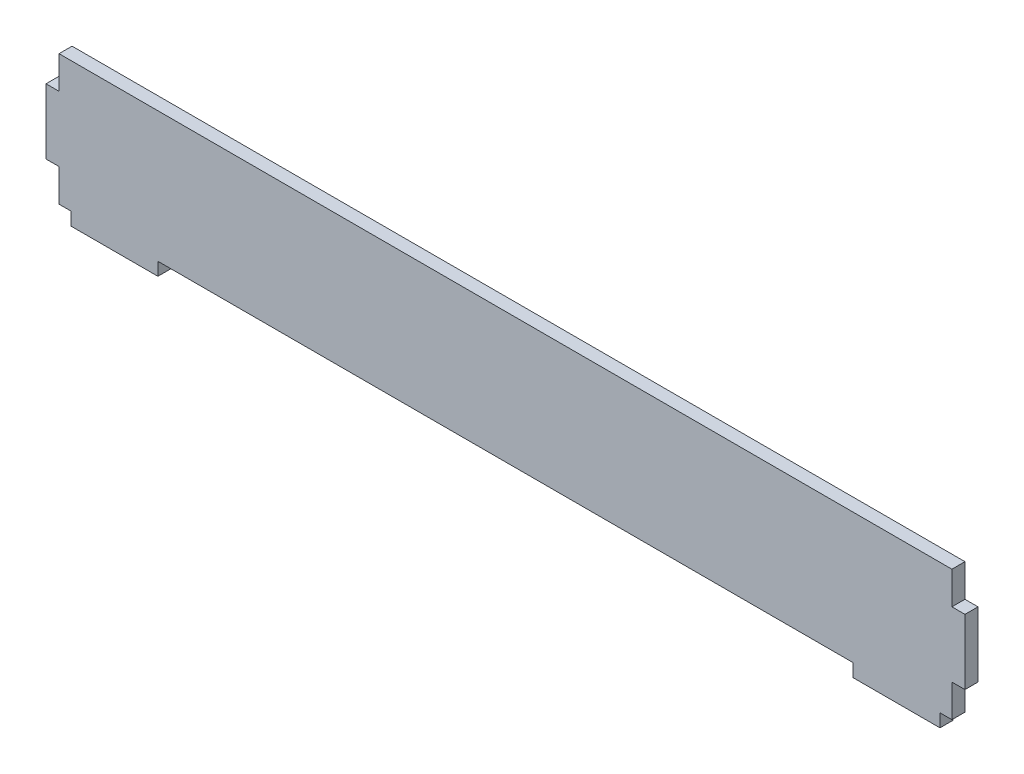
ISO-10303-21;
HEADER;
FILE_DESCRIPTION(('STEP AP214'),'2;1');
FILE_NAME('part.step','',(''),(''),'','','');
FILE_SCHEMA(('AUTOMOTIVE_DESIGN { 1 0 10303 214 1 1 1 1 }'));
ENDSEC;
DATA;
#1=APPLICATION_CONTEXT('core data for automotive mechanical design processes');
#2=APPLICATION_PROTOCOL_DEFINITION('international standard','automotive_design',2000,#1);
#3=PRODUCT_CONTEXT('',#1,'mechanical');
#4=PRODUCT('Part','Part','',(#3));
#5=PRODUCT_RELATED_PRODUCT_CATEGORY('part','',(#4));
#6=PRODUCT_DEFINITION_FORMATION('','',#4);
#7=PRODUCT_DEFINITION_CONTEXT('part definition',#1,'design');
#8=PRODUCT_DEFINITION('design','',#6,#7);
#9=PRODUCT_DEFINITION_SHAPE('','',#8);
#10=(LENGTH_UNIT() NAMED_UNIT(*) SI_UNIT(.MILLI.,.METRE.));
#11=(NAMED_UNIT(*) PLANE_ANGLE_UNIT() SI_UNIT($,.RADIAN.));
#12=(NAMED_UNIT(*) SI_UNIT($,.STERADIAN.) SOLID_ANGLE_UNIT());
#13=UNCERTAINTY_MEASURE_WITH_UNIT(LENGTH_MEASURE(1.E-05),#10,'distance_accuracy_value','');
#14=(GEOMETRIC_REPRESENTATION_CONTEXT(3) GLOBAL_UNCERTAINTY_ASSIGNED_CONTEXT((#13)) GLOBAL_UNIT_ASSIGNED_CONTEXT((#10,
#11,#12)) REPRESENTATION_CONTEXT('',''));
#15=CARTESIAN_POINT('',(0.,0.,0.));
#16=DIRECTION('',(0.,0.,1.));
#17=DIRECTION('',(1.,0.,0.));
#18=AXIS2_PLACEMENT_3D('',#15,#16,#17);
#19=CARTESIAN_POINT('',(-2.75,0.,3.));
#20=DIRECTION('',(0.,1.,0.));
#21=DIRECTION('',(0.,0.,1.));
#22=AXIS2_PLACEMENT_3D('',#19,#20,#21);
#23=PLANE('',#22);
#24=DIRECTION('',(1.,0.,0.));
#25=VECTOR('',#24,1.);
#26=CARTESIAN_POINT('',(-2.75,0.,0.));
#27=LINE('',#26,#25);
#28=CARTESIAN_POINT('',(-2.75,0.,0.));
#29=VERTEX_POINT('',#28);
#30=CARTESIAN_POINT('',(0.,0.,0.));
#31=VERTEX_POINT('',#30);
#32=EDGE_CURVE('E212',#29,#31,#27,.T.);
#33=ORIENTED_EDGE('',*,*,#32,.T.);
#34=DIRECTION('',(0.,0.,-1.));
#35=VECTOR('',#34,1.);
#36=CARTESIAN_POINT('',(0.,0.,3.));
#37=LINE('',#36,#35);
#38=CARTESIAN_POINT('',(0.,0.,3.));
#39=VERTEX_POINT('',#38);
#40=EDGE_CURVE('E11',#39,#31,#37,.T.);
#41=ORIENTED_EDGE('',*,*,#40,.F.);
#42=DIRECTION('',(1.,0.,0.));
#43=VECTOR('',#42,1.);
#44=CARTESIAN_POINT('',(-2.75,0.,3.));
#45=LINE('',#44,#43);
#46=CARTESIAN_POINT('',(-2.75,0.,3.));
#47=VERTEX_POINT('',#46);
#48=EDGE_CURVE('E271',#47,#39,#45,.T.);
#49=ORIENTED_EDGE('',*,*,#48,.F.);
#50=DIRECTION('',(0.,0.,-1.));
#51=VECTOR('',#50,1.);
#52=CARTESIAN_POINT('',(-2.75,0.,3.));
#53=LINE('',#52,#51);
#54=EDGE_CURVE('E208',#47,#29,#53,.T.);
#55=ORIENTED_EDGE('',*,*,#54,.T.);
#56=EDGE_LOOP('',(#33,#41,#49,#55));
#57=FACE_BOUND('',#56,.T.);
#58=ADVANCED_FACE('F39',(#57),#23,.F.);
#59=CARTESIAN_POINT('',(0.,0.,3.));
#60=DIRECTION('',(1.,0.,0.));
#61=DIRECTION('',(0.,0.,-1.));
#62=AXIS2_PLACEMENT_3D('',#59,#60,#61);
#63=PLANE('',#62);
#64=DIRECTION('',(0.,-1.,0.));
#65=VECTOR('',#64,1.);
#66=CARTESIAN_POINT('',(0.,0.,0.));
#67=LINE('',#66,#65);
#68=CARTESIAN_POINT('',(0.,-3.,0.));
#69=VERTEX_POINT('',#68);
#70=EDGE_CURVE('E216',#31,#69,#67,.T.);
#71=ORIENTED_EDGE('',*,*,#70,.T.);
#72=DIRECTION('',(0.,0.,-1.));
#73=VECTOR('',#72,1.);
#74=CARTESIAN_POINT('',(0.,-3.,3.));
#75=LINE('',#74,#73);
#76=CARTESIAN_POINT('',(0.,-3.,3.));
#77=VERTEX_POINT('',#76);
#78=EDGE_CURVE('E48',#77,#69,#75,.T.);
#79=ORIENTED_EDGE('',*,*,#78,.F.);
#80=DIRECTION('',(0.,-1.,0.));
#81=VECTOR('',#80,1.);
#82=CARTESIAN_POINT('',(0.,0.,3.));
#83=LINE('',#82,#81);
#84=EDGE_CURVE('E135',#39,#77,#83,.T.);
#85=ORIENTED_EDGE('',*,*,#84,.F.);
#86=ORIENTED_EDGE('',*,*,#40,.T.);
#87=EDGE_LOOP('',(#71,#79,#85,#86));
#88=FACE_BOUND('',#87,.T.);
#89=ADVANCED_FACE('F421',(#88),#63,.F.);
#90=CARTESIAN_POINT('',(0.,-3.,3.));
#91=DIRECTION('',(0.,1.,0.));
#92=DIRECTION('',(0.,0.,1.));
#93=AXIS2_PLACEMENT_3D('',#90,#91,#92);
#94=PLANE('',#93);
#95=DIRECTION('',(1.,0.,0.));
#96=VECTOR('',#95,1.);
#97=CARTESIAN_POINT('',(0.,-3.,0.));
#98=LINE('',#97,#96);
#99=CARTESIAN_POINT('',(20.,-3.,0.));
#100=VERTEX_POINT('',#99);
#101=EDGE_CURVE('E219',#69,#100,#98,.T.);
#102=ORIENTED_EDGE('',*,*,#101,.T.);
#103=DIRECTION('',(0.,0.,-1.));
#104=VECTOR('',#103,1.);
#105=CARTESIAN_POINT('',(20.,-3.,3.));
#106=LINE('',#105,#104);
#107=CARTESIAN_POINT('',(20.,-3.,3.));
#108=VERTEX_POINT('',#107);
#109=EDGE_CURVE('E330',#108,#100,#106,.T.);
#110=ORIENTED_EDGE('',*,*,#109,.F.);
#111=DIRECTION('',(1.,0.,0.));
#112=VECTOR('',#111,1.);
#113=CARTESIAN_POINT('',(0.,-3.,3.));
#114=LINE('',#113,#112);
#115=EDGE_CURVE('E340',#77,#108,#114,.T.);
#116=ORIENTED_EDGE('',*,*,#115,.F.);
#117=ORIENTED_EDGE('',*,*,#78,.T.);
#118=EDGE_LOOP('',(#102,#110,#116,#117));
#119=FACE_BOUND('',#118,.T.);
#120=ADVANCED_FACE('F338',(#119),#94,.F.);
#121=CARTESIAN_POINT('',(20.,0.,3.));
#122=DIRECTION('',(-1.,0.,0.));
#123=DIRECTION('',(0.,0.,1.));
#124=AXIS2_PLACEMENT_3D('',#121,#122,#123);
#125=PLANE('',#124);
#126=DIRECTION('',(0.,1.,0.));
#127=VECTOR('',#126,1.);
#128=CARTESIAN_POINT('',(20.,0.,0.));
#129=LINE('',#128,#127);
#130=CARTESIAN_POINT('',(20.,0.,0.));
#131=VERTEX_POINT('',#130);
#132=EDGE_CURVE('E222',#100,#131,#129,.T.);
#133=ORIENTED_EDGE('',*,*,#132,.T.);
#134=DIRECTION('',(0.,0.,-1.));
#135=VECTOR('',#134,1.);
#136=CARTESIAN_POINT('',(20.,0.,3.));
#137=LINE('',#136,#135);
#138=CARTESIAN_POINT('',(20.,0.,3.));
#139=VERTEX_POINT('',#138);
#140=EDGE_CURVE('E326',#139,#131,#137,.T.);
#141=ORIENTED_EDGE('',*,*,#140,.F.);
#142=DIRECTION('',(0.,1.,0.));
#143=VECTOR('',#142,1.);
#144=CARTESIAN_POINT('',(20.,0.,3.));
#145=LINE('',#144,#143);
#146=EDGE_CURVE('E359',#108,#139,#145,.T.);
#147=ORIENTED_EDGE('',*,*,#146,.F.);
#148=ORIENTED_EDGE('',*,*,#109,.T.);
#149=EDGE_LOOP('',(#133,#141,#147,#148));
#150=FACE_BOUND('',#149,.T.);
#151=ADVANCED_FACE('F349',(#150),#125,.F.);
#152=CARTESIAN_POINT('',(20.,0.,3.));
#153=DIRECTION('',(0.,1.,0.));
#154=DIRECTION('',(0.,0.,1.));
#155=AXIS2_PLACEMENT_3D('',#152,#153,#154);
#156=PLANE('',#155);
#157=DIRECTION('',(1.,0.,0.));
#158=VECTOR('',#157,1.);
#159=CARTESIAN_POINT('',(20.,0.,0.));
#160=LINE('',#159,#158);
#161=CARTESIAN_POINT('',(180.,0.,0.));
#162=VERTEX_POINT('',#161);
#163=EDGE_CURVE('E225',#131,#162,#160,.T.);
#164=ORIENTED_EDGE('',*,*,#163,.T.);
#165=DIRECTION('',(0.,0.,-1.));
#166=VECTOR('',#165,1.);
#167=CARTESIAN_POINT('',(180.,0.,3.));
#168=LINE('',#167,#166);
#169=CARTESIAN_POINT('',(180.,0.,3.));
#170=VERTEX_POINT('',#169);
#171=EDGE_CURVE('E322',#170,#162,#168,.T.);
#172=ORIENTED_EDGE('',*,*,#171,.F.);
#173=DIRECTION('',(1.,0.,0.));
#174=VECTOR('',#173,1.);
#175=CARTESIAN_POINT('',(20.,0.,3.));
#176=LINE('',#175,#174);
#177=EDGE_CURVE('E355',#139,#170,#176,.T.);
#178=ORIENTED_EDGE('',*,*,#177,.F.);
#179=ORIENTED_EDGE('',*,*,#140,.T.);
#180=EDGE_LOOP('',(#164,#172,#178,#179));
#181=FACE_BOUND('',#180,.T.);
#182=ADVANCED_FACE('F353',(#181),#156,.F.);
#183=CARTESIAN_POINT('',(180.,0.,3.));
#184=DIRECTION('',(1.,0.,0.));
#185=DIRECTION('',(0.,0.,-1.));
#186=AXIS2_PLACEMENT_3D('',#183,#184,#185);
#187=PLANE('',#186);
#188=DIRECTION('',(0.,-1.,0.));
#189=VECTOR('',#188,1.);
#190=CARTESIAN_POINT('',(180.,0.,0.));
#191=LINE('',#190,#189);
#192=CARTESIAN_POINT('',(180.,-3.,0.));
#193=VERTEX_POINT('',#192);
#194=EDGE_CURVE('E228',#162,#193,#191,.T.);
#195=ORIENTED_EDGE('',*,*,#194,.T.);
#196=DIRECTION('',(0.,0.,-1.));
#197=VECTOR('',#196,1.);
#198=CARTESIAN_POINT('',(180.,-3.,3.));
#199=LINE('',#198,#197);
#200=CARTESIAN_POINT('',(180.,-3.,3.));
#201=VERTEX_POINT('',#200);
#202=EDGE_CURVE('E318',#201,#193,#199,.T.);
#203=ORIENTED_EDGE('',*,*,#202,.F.);
#204=DIRECTION('',(0.,-1.,0.));
#205=VECTOR('',#204,1.);
#206=CARTESIAN_POINT('',(180.,0.,3.));
#207=LINE('',#206,#205);
#208=EDGE_CURVE('E358',#170,#201,#207,.T.);
#209=ORIENTED_EDGE('',*,*,#208,.F.);
#210=ORIENTED_EDGE('',*,*,#171,.T.);
#211=EDGE_LOOP('',(#195,#203,#209,#210));
#212=FACE_BOUND('',#211,.T.);
#213=ADVANCED_FACE('F434',(#212),#187,.F.);
#214=CARTESIAN_POINT('',(180.,-3.,3.));
#215=DIRECTION('',(0.,1.,0.));
#216=DIRECTION('',(0.,0.,1.));
#217=AXIS2_PLACEMENT_3D('',#214,#215,#216);
#218=PLANE('',#217);
#219=DIRECTION('',(1.,0.,0.));
#220=VECTOR('',#219,1.);
#221=CARTESIAN_POINT('',(180.,-3.,0.));
#222=LINE('',#221,#220);
#223=CARTESIAN_POINT('',(200.,-3.,0.));
#224=VERTEX_POINT('',#223);
#225=EDGE_CURVE('E231',#193,#224,#222,.T.);
#226=ORIENTED_EDGE('',*,*,#225,.T.);
#227=DIRECTION('',(0.,0.,-1.));
#228=VECTOR('',#227,1.);
#229=CARTESIAN_POINT('',(200.,-3.,3.));
#230=LINE('',#229,#228);
#231=CARTESIAN_POINT('',(200.,-3.,3.));
#232=VERTEX_POINT('',#231);
#233=EDGE_CURVE('E314',#232,#224,#230,.T.);
#234=ORIENTED_EDGE('',*,*,#233,.F.);
#235=DIRECTION('',(1.,0.,0.));
#236=VECTOR('',#235,1.);
#237=CARTESIAN_POINT('',(180.,-3.,3.));
#238=LINE('',#237,#236);
#239=EDGE_CURVE('E363',#201,#232,#238,.T.);
#240=ORIENTED_EDGE('',*,*,#239,.F.);
#241=ORIENTED_EDGE('',*,*,#202,.T.);
#242=EDGE_LOOP('',(#226,#234,#240,#241));
#243=FACE_BOUND('',#242,.T.);
#244=ADVANCED_FACE('F437',(#243),#218,.F.);
#245=CARTESIAN_POINT('',(200.,-3.,3.));
#246=DIRECTION('',(-1.,0.,0.));
#247=DIRECTION('',(0.,0.,1.));
#248=AXIS2_PLACEMENT_3D('',#245,#246,#247);
#249=PLANE('',#248);
#250=DIRECTION('',(0.,1.,0.));
#251=VECTOR('',#250,1.);
#252=CARTESIAN_POINT('',(200.,-3.,0.));
#253=LINE('',#252,#251);
#254=CARTESIAN_POINT('',(200.,0.,0.));
#255=VERTEX_POINT('',#254);
#256=EDGE_CURVE('E234',#224,#255,#253,.T.);
#257=ORIENTED_EDGE('',*,*,#256,.T.);
#258=DIRECTION('',(0.,0.,-1.));
#259=VECTOR('',#258,1.);
#260=CARTESIAN_POINT('',(200.,0.,3.));
#261=LINE('',#260,#259);
#262=CARTESIAN_POINT('',(200.,0.,3.));
#263=VERTEX_POINT('',#262);
#264=EDGE_CURVE('E310',#263,#255,#261,.T.);
#265=ORIENTED_EDGE('',*,*,#264,.F.);
#266=DIRECTION('',(0.,1.,0.));
#267=VECTOR('',#266,1.);
#268=CARTESIAN_POINT('',(200.,-3.,3.));
#269=LINE('',#268,#267);
#270=EDGE_CURVE('E370',#232,#263,#269,.T.);
#271=ORIENTED_EDGE('',*,*,#270,.F.);
#272=ORIENTED_EDGE('',*,*,#233,.T.);
#273=EDGE_LOOP('',(#257,#265,#271,#272));
#274=FACE_BOUND('',#273,.T.);
#275=ADVANCED_FACE('F441',(#274),#249,.F.);
#276=CARTESIAN_POINT('',(202.75,0.,3.));
#277=DIRECTION('',(0.,1.,0.));
#278=DIRECTION('',(0.,0.,1.));
#279=AXIS2_PLACEMENT_3D('',#276,#277,#278);
#280=PLANE('',#279);
#281=DIRECTION('',(1.,0.,0.));
#282=VECTOR('',#281,1.);
#283=CARTESIAN_POINT('',(202.75,0.,0.));
#284=LINE('',#283,#282);
#285=CARTESIAN_POINT('',(202.75,0.,0.));
#286=VERTEX_POINT('',#285);
#287=EDGE_CURVE('E237',#255,#286,#284,.T.);
#288=ORIENTED_EDGE('',*,*,#287,.T.);
#289=DIRECTION('',(0.,0.,-1.));
#290=VECTOR('',#289,1.);
#291=CARTESIAN_POINT('',(202.75,0.,3.));
#292=LINE('',#291,#290);
#293=CARTESIAN_POINT('',(202.75,0.,3.));
#294=VERTEX_POINT('',#293);
#295=EDGE_CURVE('E306',#294,#286,#292,.T.);
#296=ORIENTED_EDGE('',*,*,#295,.F.);
#297=DIRECTION('',(1.,0.,0.));
#298=VECTOR('',#297,1.);
#299=CARTESIAN_POINT('',(202.75,0.,3.));
#300=LINE('',#299,#298);
#301=EDGE_CURVE('E373',#263,#294,#300,.T.);
#302=ORIENTED_EDGE('',*,*,#301,.F.);
#303=ORIENTED_EDGE('',*,*,#264,.T.);
#304=EDGE_LOOP('',(#288,#296,#302,#303));
#305=FACE_BOUND('',#304,.T.);
#306=ADVANCED_FACE('F445',(#305),#280,.F.);
#307=CARTESIAN_POINT('',(202.75,7.5,3.));
#308=DIRECTION('',(-1.,0.,0.));
#309=DIRECTION('',(0.,0.,1.));
#310=AXIS2_PLACEMENT_3D('',#307,#308,#309);
#311=PLANE('',#310);
#312=DIRECTION('',(0.,1.,0.));
#313=VECTOR('',#312,1.);
#314=CARTESIAN_POINT('',(202.75,7.5,0.));
#315=LINE('',#314,#313);
#316=CARTESIAN_POINT('',(202.75,7.5,0.));
#317=VERTEX_POINT('',#316);
#318=EDGE_CURVE('E240',#286,#317,#315,.T.);
#319=ORIENTED_EDGE('',*,*,#318,.T.);
#320=DIRECTION('',(0.,0.,-1.));
#321=VECTOR('',#320,1.);
#322=CARTESIAN_POINT('',(202.75,7.5,3.));
#323=LINE('',#322,#321);
#324=CARTESIAN_POINT('',(202.75,7.5,3.));
#325=VERTEX_POINT('',#324);
#326=EDGE_CURVE('E302',#325,#317,#323,.T.);
#327=ORIENTED_EDGE('',*,*,#326,.F.);
#328=DIRECTION('',(0.,1.,0.));
#329=VECTOR('',#328,1.);
#330=CARTESIAN_POINT('',(202.75,7.5,3.));
#331=LINE('',#330,#329);
#332=EDGE_CURVE('E376',#294,#325,#331,.T.);
#333=ORIENTED_EDGE('',*,*,#332,.F.);
#334=ORIENTED_EDGE('',*,*,#295,.T.);
#335=EDGE_LOOP('',(#319,#327,#333,#334));
#336=FACE_BOUND('',#335,.T.);
#337=ADVANCED_FACE('F449',(#336),#311,.F.);
#338=CARTESIAN_POINT('',(202.75,7.5,3.));
#339=DIRECTION('',(0.,1.,0.));
#340=DIRECTION('',(0.,0.,1.));
#341=AXIS2_PLACEMENT_3D('',#338,#339,#340);
#342=PLANE('',#341);
#343=DIRECTION('',(1.,0.,0.));
#344=VECTOR('',#343,1.);
#345=CARTESIAN_POINT('',(202.75,7.5,0.));
#346=LINE('',#345,#344);
#347=CARTESIAN_POINT('',(205.75,7.5,0.));
#348=VERTEX_POINT('',#347);
#349=EDGE_CURVE('E243',#317,#348,#346,.T.);
#350=ORIENTED_EDGE('',*,*,#349,.T.);
#351=DIRECTION('',(0.,0.,-1.));
#352=VECTOR('',#351,1.);
#353=CARTESIAN_POINT('',(205.75,7.5,3.));
#354=LINE('',#353,#352);
#355=CARTESIAN_POINT('',(205.75,7.5,3.));
#356=VERTEX_POINT('',#355);
#357=EDGE_CURVE('E298',#356,#348,#354,.T.);
#358=ORIENTED_EDGE('',*,*,#357,.F.);
#359=DIRECTION('',(1.,0.,0.));
#360=VECTOR('',#359,1.);
#361=CARTESIAN_POINT('',(202.75,7.5,3.));
#362=LINE('',#361,#360);
#363=EDGE_CURVE('E379',#325,#356,#362,.T.);
#364=ORIENTED_EDGE('',*,*,#363,.F.);
#365=ORIENTED_EDGE('',*,*,#326,.T.);
#366=EDGE_LOOP('',(#350,#358,#364,#365));
#367=FACE_BOUND('',#366,.T.);
#368=ADVANCED_FACE('F453',(#367),#342,.F.);
#369=CARTESIAN_POINT('',(205.75,7.5,3.));
#370=DIRECTION('',(-1.,0.,0.));
#371=DIRECTION('',(0.,0.,1.));
#372=AXIS2_PLACEMENT_3D('',#369,#370,#371);
#373=PLANE('',#372);
#374=DIRECTION('',(0.,1.,0.));
#375=VECTOR('',#374,1.);
#376=CARTESIAN_POINT('',(205.75,7.5,0.));
#377=LINE('',#376,#375);
#378=CARTESIAN_POINT('',(205.75,22.5,0.));
#379=VERTEX_POINT('',#378);
#380=EDGE_CURVE('E246',#348,#379,#377,.T.);
#381=ORIENTED_EDGE('',*,*,#380,.T.);
#382=DIRECTION('',(0.,0.,-1.));
#383=VECTOR('',#382,1.);
#384=CARTESIAN_POINT('',(205.75,22.5,3.));
#385=LINE('',#384,#383);
#386=CARTESIAN_POINT('',(205.75,22.5,3.));
#387=VERTEX_POINT('',#386);
#388=EDGE_CURVE('E294',#387,#379,#385,.T.);
#389=ORIENTED_EDGE('',*,*,#388,.F.);
#390=DIRECTION('',(0.,1.,0.));
#391=VECTOR('',#390,1.);
#392=CARTESIAN_POINT('',(205.75,7.5,3.));
#393=LINE('',#392,#391);
#394=EDGE_CURVE('E382',#356,#387,#393,.T.);
#395=ORIENTED_EDGE('',*,*,#394,.F.);
#396=ORIENTED_EDGE('',*,*,#357,.T.);
#397=EDGE_LOOP('',(#381,#389,#395,#396));
#398=FACE_BOUND('',#397,.T.);
#399=ADVANCED_FACE('F457',(#398),#373,.F.);
#400=CARTESIAN_POINT('',(205.75,22.5,3.));
#401=DIRECTION('',(0.,-1.,0.));
#402=DIRECTION('',(0.,0.,-1.));
#403=AXIS2_PLACEMENT_3D('',#400,#401,#402);
#404=PLANE('',#403);
#405=DIRECTION('',(-1.,0.,0.));
#406=VECTOR('',#405,1.);
#407=CARTESIAN_POINT('',(205.75,22.5,0.));
#408=LINE('',#407,#406);
#409=CARTESIAN_POINT('',(202.75,22.5,0.));
#410=VERTEX_POINT('',#409);
#411=EDGE_CURVE('E249',#379,#410,#408,.T.);
#412=ORIENTED_EDGE('',*,*,#411,.T.);
#413=DIRECTION('',(0.,0.,-1.));
#414=VECTOR('',#413,1.);
#415=CARTESIAN_POINT('',(202.75,22.5,3.));
#416=LINE('',#415,#414);
#417=CARTESIAN_POINT('',(202.75,22.5,3.));
#418=VERTEX_POINT('',#417);
#419=EDGE_CURVE('E290',#418,#410,#416,.T.);
#420=ORIENTED_EDGE('',*,*,#419,.F.);
#421=DIRECTION('',(-1.,0.,0.));
#422=VECTOR('',#421,1.);
#423=CARTESIAN_POINT('',(205.75,22.5,3.));
#424=LINE('',#423,#422);
#425=EDGE_CURVE('E385',#387,#418,#424,.T.);
#426=ORIENTED_EDGE('',*,*,#425,.F.);
#427=ORIENTED_EDGE('',*,*,#388,.T.);
#428=EDGE_LOOP('',(#412,#420,#426,#427));
#429=FACE_BOUND('',#428,.T.);
#430=ADVANCED_FACE('F461',(#429),#404,.F.);
#431=CARTESIAN_POINT('',(202.75,30.,3.));
#432=DIRECTION('',(-1.,0.,0.));
#433=DIRECTION('',(0.,0.,1.));
#434=AXIS2_PLACEMENT_3D('',#431,#432,#433);
#435=PLANE('',#434);
#436=DIRECTION('',(0.,1.,0.));
#437=VECTOR('',#436,1.);
#438=CARTESIAN_POINT('',(202.75,30.,0.));
#439=LINE('',#438,#437);
#440=CARTESIAN_POINT('',(202.75,30.,0.));
#441=VERTEX_POINT('',#440);
#442=EDGE_CURVE('E252',#410,#441,#439,.T.);
#443=ORIENTED_EDGE('',*,*,#442,.T.);
#444=DIRECTION('',(0.,0.,-1.));
#445=VECTOR('',#444,1.);
#446=CARTESIAN_POINT('',(202.75,30.,3.));
#447=LINE('',#446,#445);
#448=CARTESIAN_POINT('',(202.75,30.,3.));
#449=VERTEX_POINT('',#448);
#450=EDGE_CURVE('E286',#449,#441,#447,.T.);
#451=ORIENTED_EDGE('',*,*,#450,.F.);
#452=DIRECTION('',(0.,1.,0.));
#453=VECTOR('',#452,1.);
#454=CARTESIAN_POINT('',(202.75,30.,3.));
#455=LINE('',#454,#453);
#456=EDGE_CURVE('E388',#418,#449,#455,.T.);
#457=ORIENTED_EDGE('',*,*,#456,.F.);
#458=ORIENTED_EDGE('',*,*,#419,.T.);
#459=EDGE_LOOP('',(#443,#451,#457,#458));
#460=FACE_BOUND('',#459,.T.);
#461=ADVANCED_FACE('F465',(#460),#435,.F.);
#462=CARTESIAN_POINT('',(0.,30.,3.));
#463=DIRECTION('',(0.,-1.,0.));
#464=DIRECTION('',(0.,0.,-1.));
#465=AXIS2_PLACEMENT_3D('',#462,#463,#464);
#466=PLANE('',#465);
#467=DIRECTION('',(-1.,0.,0.));
#468=VECTOR('',#467,1.);
#469=CARTESIAN_POINT('',(0.,30.,0.));
#470=LINE('',#469,#468);
#471=CARTESIAN_POINT('',(-2.75,30.,0.));
#472=VERTEX_POINT('',#471);
#473=EDGE_CURVE('E256',#441,#472,#470,.T.);
#474=ORIENTED_EDGE('',*,*,#473,.T.);
#475=DIRECTION('',(0.,0.,-1.));
#476=VECTOR('',#475,1.);
#477=CARTESIAN_POINT('',(-2.75,30.,3.));
#478=LINE('',#477,#476);
#479=CARTESIAN_POINT('',(-2.75,30.,3.));
#480=VERTEX_POINT('',#479);
#481=EDGE_CURVE('E282',#480,#472,#478,.T.);
#482=ORIENTED_EDGE('',*,*,#481,.F.);
#483=DIRECTION('',(-1.,0.,0.));
#484=VECTOR('',#483,1.);
#485=CARTESIAN_POINT('',(200.,30.,3.));
#486=LINE('',#485,#484);
#487=EDGE_CURVE('E391',#449,#480,#486,.T.);
#488=ORIENTED_EDGE('',*,*,#487,.F.);
#489=ORIENTED_EDGE('',*,*,#450,.T.);
#490=EDGE_LOOP('',(#474,#482,#488,#489));
#491=FACE_BOUND('',#490,.T.);
#492=ADVANCED_FACE('F469',(#491),#466,.F.);
#493=CARTESIAN_POINT('',(-2.75,30.,3.));
#494=DIRECTION('',(1.,0.,0.));
#495=DIRECTION('',(0.,0.,-1.));
#496=AXIS2_PLACEMENT_3D('',#493,#494,#495);
#497=PLANE('',#496);
#498=DIRECTION('',(0.,-1.,0.));
#499=VECTOR('',#498,1.);
#500=CARTESIAN_POINT('',(-2.75,30.,0.));
#501=LINE('',#500,#499);
#502=CARTESIAN_POINT('',(-2.75,22.5,0.));
#503=VERTEX_POINT('',#502);
#504=EDGE_CURVE('E259',#472,#503,#501,.T.);
#505=ORIENTED_EDGE('',*,*,#504,.T.);
#506=DIRECTION('',(0.,0.,-1.));
#507=VECTOR('',#506,1.);
#508=CARTESIAN_POINT('',(-2.75,22.5,3.));
#509=LINE('',#508,#507);
#510=CARTESIAN_POINT('',(-2.75,22.5,3.));
#511=VERTEX_POINT('',#510);
#512=EDGE_CURVE('E278',#511,#503,#509,.T.);
#513=ORIENTED_EDGE('',*,*,#512,.F.);
#514=DIRECTION('',(0.,-1.,0.));
#515=VECTOR('',#514,1.);
#516=CARTESIAN_POINT('',(-2.75,30.,3.));
#517=LINE('',#516,#515);
#518=EDGE_CURVE('E394',#480,#511,#517,.T.);
#519=ORIENTED_EDGE('',*,*,#518,.F.);
#520=ORIENTED_EDGE('',*,*,#481,.T.);
#521=EDGE_LOOP('',(#505,#513,#519,#520));
#522=FACE_BOUND('',#521,.T.);
#523=ADVANCED_FACE('F402',(#522),#497,.F.);
#524=CARTESIAN_POINT('',(-2.75,22.5,3.));
#525=DIRECTION('',(0.,-1.,0.));
#526=DIRECTION('',(0.,0.,-1.));
#527=AXIS2_PLACEMENT_3D('',#524,#525,#526);
#528=PLANE('',#527);
#529=DIRECTION('',(-1.,0.,0.));
#530=VECTOR('',#529,1.);
#531=CARTESIAN_POINT('',(-2.75,22.5,0.));
#532=LINE('',#531,#530);
#533=CARTESIAN_POINT('',(-5.75,22.5,0.));
#534=VERTEX_POINT('',#533);
#535=EDGE_CURVE('E262',#503,#534,#532,.T.);
#536=ORIENTED_EDGE('',*,*,#535,.T.);
#537=DIRECTION('',(0.,0.,-1.));
#538=VECTOR('',#537,1.);
#539=CARTESIAN_POINT('',(-5.75,22.5,3.));
#540=LINE('',#539,#538);
#541=CARTESIAN_POINT('',(-5.75,22.5,3.));
#542=VERTEX_POINT('',#541);
#543=EDGE_CURVE('E201',#542,#534,#540,.T.);
#544=ORIENTED_EDGE('',*,*,#543,.F.);
#545=DIRECTION('',(-1.,0.,0.));
#546=VECTOR('',#545,1.);
#547=CARTESIAN_POINT('',(-2.75,22.5,3.));
#548=LINE('',#547,#546);
#549=EDGE_CURVE('E190',#511,#542,#548,.T.);
#550=ORIENTED_EDGE('',*,*,#549,.F.);
#551=ORIENTED_EDGE('',*,*,#512,.T.);
#552=EDGE_LOOP('',(#536,#544,#550,#551));
#553=FACE_BOUND('',#552,.T.);
#554=ADVANCED_FACE('F406',(#553),#528,.F.);
#555=CARTESIAN_POINT('',(-5.75,22.5,3.));
#556=DIRECTION('',(1.,0.,0.));
#557=DIRECTION('',(0.,0.,-1.));
#558=AXIS2_PLACEMENT_3D('',#555,#556,#557);
#559=PLANE('',#558);
#560=DIRECTION('',(0.,-1.,0.));
#561=VECTOR('',#560,1.);
#562=CARTESIAN_POINT('',(-5.75,22.5,0.));
#563=LINE('',#562,#561);
#564=CARTESIAN_POINT('',(-5.75,7.5,0.));
#565=VERTEX_POINT('',#564);
#566=EDGE_CURVE('E199',#534,#565,#563,.T.);
#567=ORIENTED_EDGE('',*,*,#566,.T.);
#568=DIRECTION('',(0.,0.,-1.));
#569=VECTOR('',#568,1.);
#570=CARTESIAN_POINT('',(-5.75,7.5,3.));
#571=LINE('',#570,#569);
#572=CARTESIAN_POINT('',(-5.75,7.5,3.));
#573=VERTEX_POINT('',#572);
#574=EDGE_CURVE('E196',#573,#565,#571,.T.);
#575=ORIENTED_EDGE('',*,*,#574,.F.);
#576=DIRECTION('',(0.,-1.,0.));
#577=VECTOR('',#576,1.);
#578=CARTESIAN_POINT('',(-5.75,22.5,3.));
#579=LINE('',#578,#577);
#580=EDGE_CURVE('E184',#542,#573,#579,.T.);
#581=ORIENTED_EDGE('',*,*,#580,.F.);
#582=ORIENTED_EDGE('',*,*,#543,.T.);
#583=EDGE_LOOP('',(#567,#575,#581,#582));
#584=FACE_BOUND('',#583,.T.);
#585=ADVANCED_FACE('F197',(#584),#559,.F.);
#586=CARTESIAN_POINT('',(-5.75,7.5,3.));
#587=DIRECTION('',(0.,1.,0.));
#588=DIRECTION('',(0.,0.,1.));
#589=AXIS2_PLACEMENT_3D('',#586,#587,#588);
#590=PLANE('',#589);
#591=DIRECTION('',(1.,0.,0.));
#592=VECTOR('',#591,1.);
#593=CARTESIAN_POINT('',(-5.75,7.5,0.));
#594=LINE('',#593,#592);
#595=CARTESIAN_POINT('',(-2.75,7.5,0.));
#596=VERTEX_POINT('',#595);
#597=EDGE_CURVE('E121',#565,#596,#594,.T.);
#598=ORIENTED_EDGE('',*,*,#597,.T.);
#599=DIRECTION('',(0.,0.,-1.));
#600=VECTOR('',#599,1.);
#601=CARTESIAN_POINT('',(-2.75,7.5,3.));
#602=LINE('',#601,#600);
#603=CARTESIAN_POINT('',(-2.75,7.5,3.));
#604=VERTEX_POINT('',#603);
#605=EDGE_CURVE('E202',#604,#596,#602,.T.);
#606=ORIENTED_EDGE('',*,*,#605,.F.);
#607=DIRECTION('',(1.,0.,0.));
#608=VECTOR('',#607,1.);
#609=CARTESIAN_POINT('',(-5.75,7.5,3.));
#610=LINE('',#609,#608);
#611=EDGE_CURVE('E188',#573,#604,#610,.T.);
#612=ORIENTED_EDGE('',*,*,#611,.F.);
#613=ORIENTED_EDGE('',*,*,#574,.T.);
#614=EDGE_LOOP('',(#598,#606,#612,#613));
#615=FACE_BOUND('',#614,.T.);
#616=ADVANCED_FACE('F204',(#615),#590,.F.);
#617=CARTESIAN_POINT('',(-2.75,7.5,3.));
#618=DIRECTION('',(1.,0.,0.));
#619=DIRECTION('',(0.,0.,-1.));
#620=AXIS2_PLACEMENT_3D('',#617,#618,#619);
#621=PLANE('',#620);
#622=DIRECTION('',(0.,-1.,0.));
#623=VECTOR('',#622,1.);
#624=CARTESIAN_POINT('',(-2.75,7.5,0.));
#625=LINE('',#624,#623);
#626=EDGE_CURVE('E127',#596,#29,#625,.T.);
#627=ORIENTED_EDGE('',*,*,#626,.T.);
#628=ORIENTED_EDGE('',*,*,#54,.F.);
#629=DIRECTION('',(0.,-1.,0.));
#630=VECTOR('',#629,1.);
#631=CARTESIAN_POINT('',(-2.75,7.5,3.));
#632=LINE('',#631,#630);
#633=EDGE_CURVE('E56',#604,#47,#632,.T.);
#634=ORIENTED_EDGE('',*,*,#633,.F.);
#635=ORIENTED_EDGE('',*,*,#605,.T.);
#636=EDGE_LOOP('',(#627,#628,#634,#635));
#637=FACE_BOUND('',#636,.T.);
#638=ADVANCED_FACE('F410',(#637),#621,.F.);
#639=CARTESIAN_POINT('',(0.,0.,3.));
#640=DIRECTION('',(0.,0.,-1.));
#641=DIRECTION('',(-1.,0.,0.));
#642=AXIS2_PLACEMENT_3D('',#639,#640,#641);
#643=PLANE('',#642);
#644=ORIENTED_EDGE('',*,*,#48,.T.);
#645=ORIENTED_EDGE('',*,*,#84,.T.);
#646=ORIENTED_EDGE('',*,*,#115,.T.);
#647=ORIENTED_EDGE('',*,*,#146,.T.);
#648=ORIENTED_EDGE('',*,*,#177,.T.);
#649=ORIENTED_EDGE('',*,*,#208,.T.);
#650=ORIENTED_EDGE('',*,*,#239,.T.);
#651=ORIENTED_EDGE('',*,*,#270,.T.);
#652=ORIENTED_EDGE('',*,*,#301,.T.);
#653=ORIENTED_EDGE('',*,*,#332,.T.);
#654=ORIENTED_EDGE('',*,*,#363,.T.);
#655=ORIENTED_EDGE('',*,*,#394,.T.);
#656=ORIENTED_EDGE('',*,*,#425,.T.);
#657=ORIENTED_EDGE('',*,*,#456,.T.);
#658=ORIENTED_EDGE('',*,*,#487,.T.);
#659=ORIENTED_EDGE('',*,*,#518,.T.);
#660=ORIENTED_EDGE('',*,*,#549,.T.);
#661=ORIENTED_EDGE('',*,*,#580,.T.);
#662=ORIENTED_EDGE('',*,*,#611,.T.);
#663=ORIENTED_EDGE('',*,*,#633,.T.);
#664=EDGE_LOOP('',(#644,#645,#646,#647,#648,#649,#650,#651,#652,#653,#654,#655,#656,#657,#658,
#659,#660,#661,#662,#663));
#665=FACE_BOUND('',#664,.T.);
#666=ADVANCED_FACE('F186',(#665),#643,.F.);
#667=CARTESIAN_POINT('',(0.,0.,0.));
#668=DIRECTION('',(0.,0.,-1.));
#669=DIRECTION('',(-1.,0.,0.));
#670=AXIS2_PLACEMENT_3D('',#667,#668,#669);
#671=PLANE('',#670);
#672=ORIENTED_EDGE('',*,*,#32,.F.);
#673=ORIENTED_EDGE('',*,*,#626,.F.);
#674=ORIENTED_EDGE('',*,*,#597,.F.);
#675=ORIENTED_EDGE('',*,*,#566,.F.);
#676=ORIENTED_EDGE('',*,*,#535,.F.);
#677=ORIENTED_EDGE('',*,*,#504,.F.);
#678=ORIENTED_EDGE('',*,*,#473,.F.);
#679=ORIENTED_EDGE('',*,*,#442,.F.);
#680=ORIENTED_EDGE('',*,*,#411,.F.);
#681=ORIENTED_EDGE('',*,*,#380,.F.);
#682=ORIENTED_EDGE('',*,*,#349,.F.);
#683=ORIENTED_EDGE('',*,*,#318,.F.);
#684=ORIENTED_EDGE('',*,*,#287,.F.);
#685=ORIENTED_EDGE('',*,*,#256,.F.);
#686=ORIENTED_EDGE('',*,*,#225,.F.);
#687=ORIENTED_EDGE('',*,*,#194,.F.);
#688=ORIENTED_EDGE('',*,*,#163,.F.);
#689=ORIENTED_EDGE('',*,*,#132,.F.);
#690=ORIENTED_EDGE('',*,*,#101,.F.);
#691=ORIENTED_EDGE('',*,*,#70,.F.);
#692=EDGE_LOOP('',(#672,#673,#674,#675,#676,#677,#678,#679,#680,#681,#682,#683,#684,#685,#686,
#687,#688,#689,#690,#691));
#693=FACE_BOUND('',#692,.T.);
#694=ADVANCED_FACE('F344',(#693),#671,.T.);
#695=CLOSED_SHELL('',(#58,#89,#120,#151,#182,#213,#244,#275,#306,#337,#368,#399,#430,#461,#492,
#523,#554,#585,#616,#638,#666,#694));
#696=MANIFOLD_SOLID_BREP('B2',#695);
#697=ADVANCED_BREP_SHAPE_REPRESENTATION('',(#18,#696),#14);
#698=SHAPE_DEFINITION_REPRESENTATION(#9,#697);
ENDSEC;
END-ISO-10303-21;
